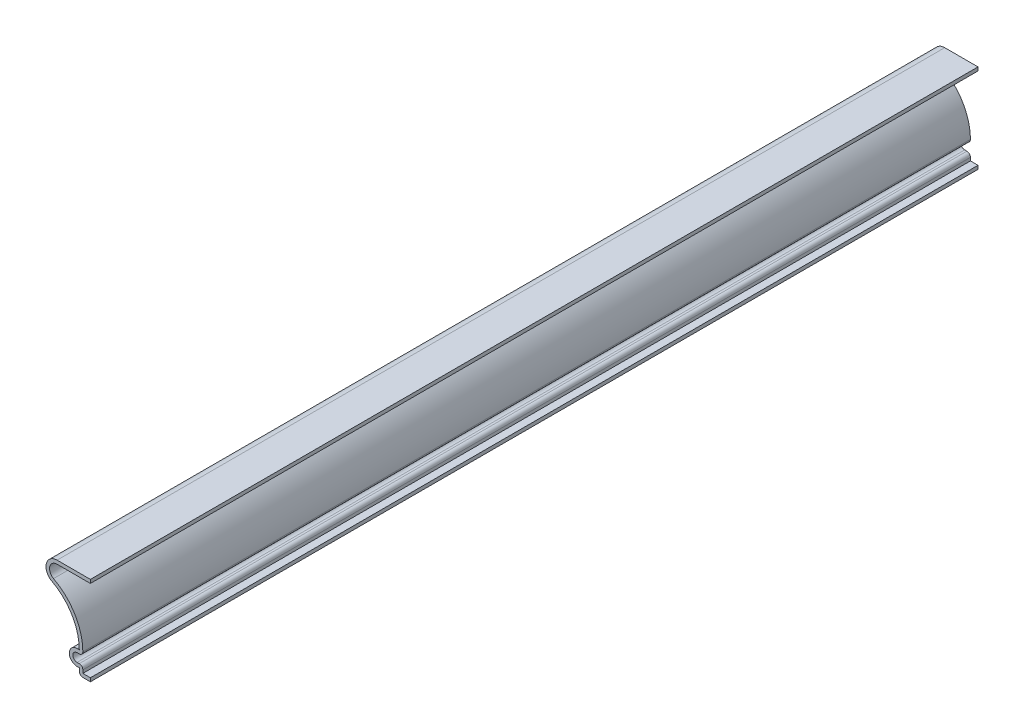
ISO-10303-21;
HEADER;
FILE_DESCRIPTION(('STEP AP214'),'2;1');
FILE_NAME('part.step','',(''),(''),'','','');
FILE_SCHEMA(('AUTOMOTIVE_DESIGN { 1 0 10303 214 1 1 1 1 }'));
ENDSEC;
DATA;
#1=APPLICATION_CONTEXT('core data for automotive mechanical design processes');
#2=APPLICATION_PROTOCOL_DEFINITION('international standard','automotive_design',2000,#1);
#3=PRODUCT_CONTEXT('',#1,'mechanical');
#4=PRODUCT('Part','Part','',(#3));
#5=PRODUCT_RELATED_PRODUCT_CATEGORY('part','',(#4));
#6=PRODUCT_DEFINITION_FORMATION('','',#4);
#7=PRODUCT_DEFINITION_CONTEXT('part definition',#1,'design');
#8=PRODUCT_DEFINITION('design','',#6,#7);
#9=PRODUCT_DEFINITION_SHAPE('','',#8);
#10=(LENGTH_UNIT() NAMED_UNIT(*) SI_UNIT(.MILLI.,.METRE.));
#11=(NAMED_UNIT(*) PLANE_ANGLE_UNIT() SI_UNIT($,.RADIAN.));
#12=(NAMED_UNIT(*) SI_UNIT($,.STERADIAN.) SOLID_ANGLE_UNIT());
#13=UNCERTAINTY_MEASURE_WITH_UNIT(LENGTH_MEASURE(1.E-05),#10,'distance_accuracy_value','');
#14=(GEOMETRIC_REPRESENTATION_CONTEXT(3) GLOBAL_UNCERTAINTY_ASSIGNED_CONTEXT((#13)) GLOBAL_UNIT_ASSIGNED_CONTEXT((#10,
#11,#12)) REPRESENTATION_CONTEXT('',''));
#15=CARTESIAN_POINT('',(0.,0.,0.));
#16=DIRECTION('',(0.,0.,1.));
#17=DIRECTION('',(1.,0.,0.));
#18=AXIS2_PLACEMENT_3D('',#15,#16,#17);
#19=CARTESIAN_POINT('',(0.,0.,-317.5));
#20=DIRECTION('',(0.,-1.,0.));
#21=DIRECTION('',(0.,0.,-1.));
#22=AXIS2_PLACEMENT_3D('',#19,#20,#21);
#23=PLANE('',#22);
#24=DIRECTION('',(1.,0.,0.));
#25=VECTOR('',#24,1.);
#26=CARTESIAN_POINT('',(0.,0.,0.));
#27=LINE('',#26,#25);
#28=CARTESIAN_POINT('',(-2.69875,0.,0.));
#29=VERTEX_POINT('',#28);
#30=CARTESIAN_POINT('',(0.,0.,0.));
#31=VERTEX_POINT('',#30);
#32=EDGE_CURVE('E372',#29,#31,#27,.T.);
#33=ORIENTED_EDGE('',*,*,#32,.F.);
#34=DIRECTION('',(0.,0.,1.));
#35=VECTOR('',#34,1.);
#36=CARTESIAN_POINT('',(-2.69875,0.,-317.5));
#37=LINE('',#36,#35);
#38=CARTESIAN_POINT('',(-2.69875,0.,-317.5));
#39=VERTEX_POINT('',#38);
#40=EDGE_CURVE('E193',#29,#39,#37,.F.);
#41=ORIENTED_EDGE('',*,*,#40,.T.);
#42=DIRECTION('',(1.,0.,0.));
#43=VECTOR('',#42,1.);
#44=CARTESIAN_POINT('',(0.,0.,-317.5));
#45=LINE('',#44,#43);
#46=CARTESIAN_POINT('',(0.,0.,-317.5));
#47=VERTEX_POINT('',#46);
#48=EDGE_CURVE('E186',#39,#47,#45,.T.);
#49=ORIENTED_EDGE('',*,*,#48,.T.);
#50=DIRECTION('',(0.,0.,1.));
#51=VECTOR('',#50,1.);
#52=CARTESIAN_POINT('',(0.,0.,-317.5));
#53=LINE('',#52,#51);
#54=EDGE_CURVE('E190',#47,#31,#53,.T.);
#55=ORIENTED_EDGE('',*,*,#54,.T.);
#56=EDGE_LOOP('',(#33,#41,#49,#55));
#57=FACE_BOUND('',#56,.T.);
#58=ADVANCED_FACE('F41',(#57),#23,.T.);
#59=CARTESIAN_POINT('',(-3.96875,0.,-317.5));
#60=DIRECTION('',(-1.,0.,0.));
#61=DIRECTION('',(0.,0.,1.));
#62=AXIS2_PLACEMENT_3D('',#59,#60,#61);
#63=PLANE('',#62);
#64=DIRECTION('',(0.,-1.,0.));
#65=VECTOR('',#64,1.);
#66=CARTESIAN_POINT('',(-3.96875,0.,-317.5));
#67=LINE('',#66,#65);
#68=CARTESIAN_POINT('',(-3.96875,2.38125,-317.5));
#69=VERTEX_POINT('',#68);
#70=CARTESIAN_POINT('',(-3.96875,1.27,-317.5));
#71=VERTEX_POINT('',#70);
#72=EDGE_CURVE('E213',#69,#71,#67,.T.);
#73=ORIENTED_EDGE('',*,*,#72,.T.);
#74=DIRECTION('',(0.,0.,1.));
#75=VECTOR('',#74,1.);
#76=CARTESIAN_POINT('',(-3.96875,1.27,-317.5));
#77=LINE('',#76,#75);
#78=CARTESIAN_POINT('',(-3.96875,1.27,0.));
#79=VERTEX_POINT('',#78);
#80=EDGE_CURVE('E224',#71,#79,#77,.T.);
#81=ORIENTED_EDGE('',*,*,#80,.T.);
#82=DIRECTION('',(0.,-1.,0.));
#83=VECTOR('',#82,1.);
#84=CARTESIAN_POINT('',(-3.96875,0.,0.));
#85=LINE('',#84,#83);
#86=CARTESIAN_POINT('',(-3.96875,2.38125,0.));
#87=VERTEX_POINT('',#86);
#88=EDGE_CURVE('E197',#87,#79,#85,.T.);
#89=ORIENTED_EDGE('',*,*,#88,.F.);
#90=DIRECTION('',(0.,0.,1.));
#91=VECTOR('',#90,1.);
#92=CARTESIAN_POINT('',(-3.96875,2.38125,-317.5));
#93=LINE('',#92,#91);
#94=EDGE_CURVE('E229',#69,#87,#93,.T.);
#95=ORIENTED_EDGE('',*,*,#94,.F.);
#96=EDGE_LOOP('',(#73,#81,#89,#95));
#97=FACE_BOUND('',#96,.T.);
#98=ADVANCED_FACE('F438',(#97),#63,.T.);
#99=CARTESIAN_POINT('',(-3.96875,2.38125,-317.5));
#100=DIRECTION('',(0.,-1.,0.));
#101=DIRECTION('',(1.,0.,0.));
#102=AXIS2_PLACEMENT_3D('',#99,#100,#101);
#103=PLANE('',#102);
#104=DIRECTION('',(1.,0.,0.));
#105=VECTOR('',#104,1.);
#106=CARTESIAN_POINT('',(-3.96875,2.38125,0.));
#107=LINE('',#106,#105);
#108=CARTESIAN_POINT('',(-4.7625,2.38125,0.));
#109=VERTEX_POINT('',#108);
#110=EDGE_CURVE('E313',#109,#87,#107,.T.);
#111=ORIENTED_EDGE('',*,*,#110,.F.);
#112=DIRECTION('',(0.,0.,1.));
#113=VECTOR('',#112,1.);
#114=CARTESIAN_POINT('',(-4.7625,2.38125,-317.5));
#115=LINE('',#114,#113);
#116=CARTESIAN_POINT('',(-4.7625,2.38125,-317.5));
#117=VERTEX_POINT('',#116);
#118=EDGE_CURVE('E321',#117,#109,#115,.T.);
#119=ORIENTED_EDGE('',*,*,#118,.F.);
#120=DIRECTION('',(1.,0.,0.));
#121=VECTOR('',#120,1.);
#122=CARTESIAN_POINT('',(-3.96875,2.38125,-317.5));
#123=LINE('',#122,#121);
#124=EDGE_CURVE('E220',#117,#69,#123,.T.);
#125=ORIENTED_EDGE('',*,*,#124,.T.);
#126=ORIENTED_EDGE('',*,*,#94,.T.);
#127=EDGE_LOOP('',(#111,#119,#125,#126));
#128=FACE_BOUND('',#127,.T.);
#129=ADVANCED_FACE('F442',(#128),#103,.T.);
#130=CARTESIAN_POINT('',(-4.7625,5.159375,-317.5));
#131=DIRECTION('',(0.,0.,1.));
#132=DIRECTION('',(1.,0.,0.));
#133=AXIS2_PLACEMENT_3D('',#130,#131,#132);
#134=CYLINDRICAL_SURFACE('',#133,2.778125);
#135=CARTESIAN_POINT('',(-4.7625,5.159375,0.));
#136=DIRECTION('',(0.,0.,1.));
#137=DIRECTION('',(-1.,0.,0.));
#138=AXIS2_PLACEMENT_3D('',#135,#136,#137);
#139=CIRCLE('',#138,2.778125);
#140=CARTESIAN_POINT('',(-4.7625,7.9375,0.));
#141=VERTEX_POINT('',#140);
#142=EDGE_CURVE('E309',#141,#109,#139,.T.);
#143=ORIENTED_EDGE('',*,*,#142,.F.);
#144=DIRECTION('',(0.,0.,1.));
#145=VECTOR('',#144,1.);
#146=CARTESIAN_POINT('',(-4.7625,7.9375,-317.5));
#147=LINE('',#146,#145);
#148=CARTESIAN_POINT('',(-4.7625,7.9375,-317.5));
#149=VERTEX_POINT('',#148);
#150=EDGE_CURVE('E324',#149,#141,#147,.T.);
#151=ORIENTED_EDGE('',*,*,#150,.F.);
#152=CARTESIAN_POINT('',(-4.7625,5.159375,-317.5));
#153=DIRECTION('',(0.,0.,1.));
#154=DIRECTION('',(-1.,0.,0.));
#155=AXIS2_PLACEMENT_3D('',#152,#153,#154);
#156=CIRCLE('',#155,2.778125);
#157=EDGE_CURVE('E425',#149,#117,#156,.T.);
#158=ORIENTED_EDGE('',*,*,#157,.T.);
#159=ORIENTED_EDGE('',*,*,#118,.T.);
#160=EDGE_LOOP('',(#143,#151,#158,#159));
#161=FACE_BOUND('',#160,.T.);
#162=ADVANCED_FACE('F447',(#161),#134,.T.);
#163=CARTESIAN_POINT('',(-4.7625,7.9375,-317.5));
#164=DIRECTION('',(0.,1.,0.));
#165=DIRECTION('',(0.,0.,1.));
#166=AXIS2_PLACEMENT_3D('',#163,#164,#165);
#167=PLANE('',#166);
#168=DIRECTION('',(-1.,0.,0.));
#169=VECTOR('',#168,1.);
#170=CARTESIAN_POINT('',(-4.7625,7.9375,0.));
#171=LINE('',#170,#169);
#172=CARTESIAN_POINT('',(-3.96875,7.9375,0.));
#173=VERTEX_POINT('',#172);
#174=EDGE_CURVE('E305',#173,#141,#171,.T.);
#175=ORIENTED_EDGE('',*,*,#174,.F.);
#176=DIRECTION('',(0.,0.,1.));
#177=VECTOR('',#176,1.);
#178=CARTESIAN_POINT('',(-3.96875,7.9375,-317.5));
#179=LINE('',#178,#177);
#180=CARTESIAN_POINT('',(-3.96875,7.9375,-317.5));
#181=VERTEX_POINT('',#180);
#182=EDGE_CURVE('E327',#181,#173,#179,.T.);
#183=ORIENTED_EDGE('',*,*,#182,.F.);
#184=DIRECTION('',(-1.,0.,0.));
#185=VECTOR('',#184,1.);
#186=CARTESIAN_POINT('',(-4.7625,7.9375,-317.5));
#187=LINE('',#186,#185);
#188=EDGE_CURVE('E421',#181,#149,#187,.T.);
#189=ORIENTED_EDGE('',*,*,#188,.T.);
#190=ORIENTED_EDGE('',*,*,#150,.T.);
#191=EDGE_LOOP('',(#175,#183,#189,#190));
#192=FACE_BOUND('',#191,.T.);
#193=ADVANCED_FACE('F450',(#192),#167,.T.);
#194=CARTESIAN_POINT('',(-22.4895833333332,7.9375,-317.5));
#195=DIRECTION('',(0.,0.,1.));
#196=DIRECTION('',(1.,0.,0.));
#197=AXIS2_PLACEMENT_3D('',#194,#195,#196);
#198=CYLINDRICAL_SURFACE('',#197,18.5208333333332);
#199=CARTESIAN_POINT('',(-22.4895833333332,7.9375,0.));
#200=DIRECTION('',(0.,0.,-1.));
#201=DIRECTION('',(-1.,0.,0.));
#202=AXIS2_PLACEMENT_3D('',#199,#200,#201);
#203=CIRCLE('',#202,18.5208333333332);
#204=CARTESIAN_POINT('',(-13.7738970588235,24.2794117647058,0.));
#205=VERTEX_POINT('',#204);
#206=EDGE_CURVE('E301',#205,#173,#203,.T.);
#207=ORIENTED_EDGE('',*,*,#206,.F.);
#208=DIRECTION('',(0.,0.,1.));
#209=VECTOR('',#208,1.);
#210=CARTESIAN_POINT('',(-13.7738970588235,24.2794117647058,-317.5));
#211=LINE('',#210,#209);
#212=CARTESIAN_POINT('',(-13.7738970588235,24.2794117647058,-317.5));
#213=VERTEX_POINT('',#212);
#214=EDGE_CURVE('E330',#213,#205,#211,.T.);
#215=ORIENTED_EDGE('',*,*,#214,.F.);
#216=CARTESIAN_POINT('',(-22.4895833333332,7.9375,-317.5));
#217=DIRECTION('',(0.,0.,-1.));
#218=DIRECTION('',(-1.,0.,0.));
#219=AXIS2_PLACEMENT_3D('',#216,#217,#218);
#220=CIRCLE('',#219,18.5208333333332);
#221=EDGE_CURVE('E417',#213,#181,#220,.T.);
#222=ORIENTED_EDGE('',*,*,#221,.T.);
#223=ORIENTED_EDGE('',*,*,#182,.T.);
#224=EDGE_LOOP('',(#207,#215,#222,#223));
#225=FACE_BOUND('',#224,.T.);
#226=ADVANCED_FACE('F455',(#225),#198,.F.);
#227=CARTESIAN_POINT('',(-11.90625,27.78125,-317.5));
#228=DIRECTION('',(0.,0.,1.));
#229=DIRECTION('',(1.,0.,0.));
#230=AXIS2_PLACEMENT_3D('',#227,#228,#229);
#231=CYLINDRICAL_SURFACE('',#230,3.96875000000003);
#232=CARTESIAN_POINT('',(-11.90625,27.78125,0.));
#233=DIRECTION('',(0.,0.,1.));
#234=DIRECTION('',(1.,0.,0.));
#235=AXIS2_PLACEMENT_3D('',#232,#233,#234);
#236=CIRCLE('',#235,3.96875000000003);
#237=CARTESIAN_POINT('',(-11.90625,31.75,0.));
#238=VERTEX_POINT('',#237);
#239=EDGE_CURVE('E297',#238,#205,#236,.T.);
#240=ORIENTED_EDGE('',*,*,#239,.F.);
#241=DIRECTION('',(0.,0.,1.));
#242=VECTOR('',#241,1.);
#243=CARTESIAN_POINT('',(-11.90625,31.75,-317.5));
#244=LINE('',#243,#242);
#245=CARTESIAN_POINT('',(-11.90625,31.75,-317.5));
#246=VERTEX_POINT('',#245);
#247=EDGE_CURVE('E333',#246,#238,#244,.T.);
#248=ORIENTED_EDGE('',*,*,#247,.F.);
#249=CARTESIAN_POINT('',(-11.90625,27.78125,-317.5));
#250=DIRECTION('',(0.,0.,1.));
#251=DIRECTION('',(1.,0.,0.));
#252=AXIS2_PLACEMENT_3D('',#249,#250,#251);
#253=CIRCLE('',#252,3.96875000000003);
#254=EDGE_CURVE('E413',#246,#213,#253,.T.);
#255=ORIENTED_EDGE('',*,*,#254,.T.);
#256=ORIENTED_EDGE('',*,*,#214,.T.);
#257=EDGE_LOOP('',(#240,#248,#255,#256));
#258=FACE_BOUND('',#257,.T.);
#259=ADVANCED_FACE('F458',(#258),#231,.T.);
#260=CARTESIAN_POINT('',(0.,31.75,-317.5));
#261=DIRECTION('',(0.,1.,0.));
#262=DIRECTION('',(0.,0.,1.));
#263=AXIS2_PLACEMENT_3D('',#260,#261,#262);
#264=PLANE('',#263);
#265=DIRECTION('',(-1.,0.,0.));
#266=VECTOR('',#265,1.);
#267=CARTESIAN_POINT('',(0.,31.75,0.));
#268=LINE('',#267,#266);
#269=CARTESIAN_POINT('',(0.,31.75,0.));
#270=VERTEX_POINT('',#269);
#271=EDGE_CURVE('E293',#270,#238,#268,.T.);
#272=ORIENTED_EDGE('',*,*,#271,.F.);
#273=DIRECTION('',(0.,0.,1.));
#274=VECTOR('',#273,1.);
#275=CARTESIAN_POINT('',(0.,31.75,-317.5));
#276=LINE('',#275,#274);
#277=CARTESIAN_POINT('',(0.,31.75,-317.5));
#278=VERTEX_POINT('',#277);
#279=EDGE_CURVE('E336',#278,#270,#276,.T.);
#280=ORIENTED_EDGE('',*,*,#279,.F.);
#281=DIRECTION('',(-1.,0.,0.));
#282=VECTOR('',#281,1.);
#283=CARTESIAN_POINT('',(0.,31.75,-317.5));
#284=LINE('',#283,#282);
#285=EDGE_CURVE('E409',#278,#246,#284,.T.);
#286=ORIENTED_EDGE('',*,*,#285,.T.);
#287=ORIENTED_EDGE('',*,*,#247,.T.);
#288=EDGE_LOOP('',(#272,#280,#286,#287));
#289=FACE_BOUND('',#288,.T.);
#290=ADVANCED_FACE('F462',(#289),#264,.T.);
#291=CARTESIAN_POINT('',(0.,31.75,-317.5));
#292=DIRECTION('',(-1.,0.,0.));
#293=DIRECTION('',(0.,0.,1.));
#294=AXIS2_PLACEMENT_3D('',#291,#292,#293);
#295=PLANE('',#294);
#296=DIRECTION('',(0.,-1.,0.));
#297=VECTOR('',#296,1.);
#298=CARTESIAN_POINT('',(0.,31.75,0.));
#299=LINE('',#298,#297);
#300=CARTESIAN_POINT('',(0.,30.48,0.));
#301=VERTEX_POINT('',#300);
#302=EDGE_CURVE('E290',#270,#301,#299,.T.);
#303=ORIENTED_EDGE('',*,*,#302,.T.);
#304=DIRECTION('',(0.,0.,1.));
#305=VECTOR('',#304,1.);
#306=CARTESIAN_POINT('',(0.,30.48,-317.5));
#307=LINE('',#306,#305);
#308=CARTESIAN_POINT('',(0.,30.48,-317.5));
#309=VERTEX_POINT('',#308);
#310=EDGE_CURVE('E339',#309,#301,#307,.T.);
#311=ORIENTED_EDGE('',*,*,#310,.F.);
#312=DIRECTION('',(0.,-1.,0.));
#313=VECTOR('',#312,1.);
#314=CARTESIAN_POINT('',(0.,31.75,-317.5));
#315=LINE('',#314,#313);
#316=EDGE_CURVE('E406',#278,#309,#315,.T.);
#317=ORIENTED_EDGE('',*,*,#316,.F.);
#318=ORIENTED_EDGE('',*,*,#279,.T.);
#319=EDGE_LOOP('',(#303,#311,#317,#318));
#320=FACE_BOUND('',#319,.T.);
#321=ADVANCED_FACE('F467',(#320),#295,.F.);
#322=CARTESIAN_POINT('',(0.,30.48,-317.5));
#323=DIRECTION('',(0.,1.,0.));
#324=DIRECTION('',(0.,0.,1.));
#325=AXIS2_PLACEMENT_3D('',#322,#323,#324);
#326=PLANE('',#325);
#327=DIRECTION('',(1.,0.,0.));
#328=VECTOR('',#327,1.);
#329=CARTESIAN_POINT('',(0.,30.48,0.));
#330=LINE('',#329,#328);
#331=CARTESIAN_POINT('',(-11.90625,30.48,0.));
#332=VERTEX_POINT('',#331);
#333=EDGE_CURVE('E287',#301,#332,#330,.F.);
#334=ORIENTED_EDGE('',*,*,#333,.T.);
#335=DIRECTION('',(0.,0.,1.));
#336=VECTOR('',#335,1.);
#337=CARTESIAN_POINT('',(-11.90625,30.48,-317.5));
#338=LINE('',#337,#336);
#339=CARTESIAN_POINT('',(-11.90625,30.48,-317.5));
#340=VERTEX_POINT('',#339);
#341=EDGE_CURVE('E343',#340,#332,#338,.T.);
#342=ORIENTED_EDGE('',*,*,#341,.F.);
#343=DIRECTION('',(1.,0.,0.));
#344=VECTOR('',#343,1.);
#345=CARTESIAN_POINT('',(0.,30.48,-317.5));
#346=LINE('',#345,#344);
#347=EDGE_CURVE('E403',#309,#340,#346,.F.);
#348=ORIENTED_EDGE('',*,*,#347,.F.);
#349=ORIENTED_EDGE('',*,*,#310,.T.);
#350=EDGE_LOOP('',(#334,#342,#348,#349));
#351=FACE_BOUND('',#350,.T.);
#352=ADVANCED_FACE('F473',(#351),#326,.F.);
#353=CARTESIAN_POINT('',(-11.90625,27.78125,-317.5));
#354=DIRECTION('',(0.,0.,1.));
#355=DIRECTION('',(1.,0.,0.));
#356=AXIS2_PLACEMENT_3D('',#353,#354,#355);
#357=CYLINDRICAL_SURFACE('',#356,2.69875000000003);
#358=CARTESIAN_POINT('',(-11.90625,27.78125,0.));
#359=DIRECTION('',(0.,0.,1.));
#360=DIRECTION('',(1.,0.,0.));
#361=AXIS2_PLACEMENT_3D('',#358,#359,#360);
#362=CIRCLE('',#361,2.69875000000003);
#363=CARTESIAN_POINT('',(-13.17625,25.3999999999999,0.));
#364=VERTEX_POINT('',#363);
#365=EDGE_CURVE('E279',#332,#364,#362,.T.);
#366=ORIENTED_EDGE('',*,*,#365,.T.);
#367=DIRECTION('',(0.,0.,1.));
#368=VECTOR('',#367,1.);
#369=CARTESIAN_POINT('',(-13.17625,25.3999999999999,-317.5));
#370=LINE('',#369,#368);
#371=CARTESIAN_POINT('',(-13.17625,25.3999999999999,-317.5));
#372=VERTEX_POINT('',#371);
#373=EDGE_CURVE('E347',#372,#364,#370,.T.);
#374=ORIENTED_EDGE('',*,*,#373,.F.);
#375=CARTESIAN_POINT('',(-11.90625,27.78125,-317.5));
#376=DIRECTION('',(0.,0.,1.));
#377=DIRECTION('',(1.,0.,0.));
#378=AXIS2_PLACEMENT_3D('',#375,#376,#377);
#379=CIRCLE('',#378,2.69875000000003);
#380=EDGE_CURVE('E400',#340,#372,#379,.T.);
#381=ORIENTED_EDGE('',*,*,#380,.F.);
#382=ORIENTED_EDGE('',*,*,#341,.T.);
#383=EDGE_LOOP('',(#366,#374,#381,#382));
#384=FACE_BOUND('',#383,.T.);
#385=ADVANCED_FACE('F477',(#384),#357,.F.);
#386=CARTESIAN_POINT('',(-22.4895833333332,7.9375,-317.5));
#387=DIRECTION('',(0.,0.,1.));
#388=DIRECTION('',(1.,0.,0.));
#389=AXIS2_PLACEMENT_3D('',#386,#387,#388);
#390=CYLINDRICAL_SURFACE('',#389,19.7908333333332);
#391=CARTESIAN_POINT('',(-22.4895833333332,7.9375,0.));
#392=DIRECTION('',(0.,0.,1.));
#393=DIRECTION('',(1.,0.,0.));
#394=AXIS2_PLACEMENT_3D('',#391,#392,#393);
#395=CIRCLE('',#394,19.7908333333332);
#396=CARTESIAN_POINT('',(-2.69875,7.9375,0.));
#397=VERTEX_POINT('',#396);
#398=EDGE_CURVE('E275',#364,#397,#395,.F.);
#399=ORIENTED_EDGE('',*,*,#398,.T.);
#400=DIRECTION('',(0.,0.,1.));
#401=VECTOR('',#400,1.);
#402=CARTESIAN_POINT('',(-2.69875,7.9375,-317.5));
#403=LINE('',#402,#401);
#404=CARTESIAN_POINT('',(-2.69875,7.9375,-317.5));
#405=VERTEX_POINT('',#404);
#406=EDGE_CURVE('E11',#397,#405,#403,.F.);
#407=ORIENTED_EDGE('',*,*,#406,.T.);
#408=CARTESIAN_POINT('',(-22.4895833333332,7.9375,-317.5));
#409=DIRECTION('',(0.,0.,1.));
#410=DIRECTION('',(1.,0.,0.));
#411=AXIS2_PLACEMENT_3D('',#408,#409,#410);
#412=CIRCLE('',#411,19.7908333333332);
#413=EDGE_CURVE('E396',#372,#405,#412,.F.);
#414=ORIENTED_EDGE('',*,*,#413,.F.);
#415=ORIENTED_EDGE('',*,*,#373,.T.);
#416=EDGE_LOOP('',(#399,#407,#414,#415));
#417=FACE_BOUND('',#416,.T.);
#418=ADVANCED_FACE('F480',(#417),#390,.T.);
#419=CARTESIAN_POINT('',(-4.7625,6.6675,-317.5));
#420=DIRECTION('',(0.,1.,0.));
#421=DIRECTION('',(0.,0.,1.));
#422=AXIS2_PLACEMENT_3D('',#419,#420,#421);
#423=PLANE('',#422);
#424=DIRECTION('',(1.,0.,0.));
#425=VECTOR('',#424,1.);
#426=CARTESIAN_POINT('',(-4.7625,6.6675,-317.5));
#427=LINE('',#426,#425);
#428=CARTESIAN_POINT('',(-3.96875,6.6675,-317.5));
#429=VERTEX_POINT('',#428);
#430=CARTESIAN_POINT('',(-4.7625,6.6675,-317.5));
#431=VERTEX_POINT('',#430);
#432=EDGE_CURVE('E263',#429,#431,#427,.F.);
#433=ORIENTED_EDGE('',*,*,#432,.F.);
#434=DIRECTION('',(0.,0.,1.));
#435=VECTOR('',#434,1.);
#436=CARTESIAN_POINT('',(-3.96875,6.6675,-317.5));
#437=LINE('',#436,#435);
#438=CARTESIAN_POINT('',(-3.96875,6.6675,0.));
#439=VERTEX_POINT('',#438);
#440=EDGE_CURVE('E50',#429,#439,#437,.T.);
#441=ORIENTED_EDGE('',*,*,#440,.T.);
#442=DIRECTION('',(1.,0.,0.));
#443=VECTOR('',#442,1.);
#444=CARTESIAN_POINT('',(-4.7625,6.6675,0.));
#445=LINE('',#444,#443);
#446=CARTESIAN_POINT('',(-4.7625,6.6675,0.));
#447=VERTEX_POINT('',#446);
#448=EDGE_CURVE('E261',#439,#447,#445,.F.);
#449=ORIENTED_EDGE('',*,*,#448,.T.);
#450=DIRECTION('',(0.,0.,1.));
#451=VECTOR('',#450,1.);
#452=CARTESIAN_POINT('',(-4.7625,6.6675,-317.5));
#453=LINE('',#452,#451);
#454=EDGE_CURVE('E351',#431,#447,#453,.T.);
#455=ORIENTED_EDGE('',*,*,#454,.F.);
#456=EDGE_LOOP('',(#433,#441,#449,#455));
#457=FACE_BOUND('',#456,.T.);
#458=ADVANCED_FACE('F259',(#457),#423,.F.);
#459=CARTESIAN_POINT('',(-4.7625,5.159375,-317.5));
#460=DIRECTION('',(0.,0.,1.));
#461=DIRECTION('',(1.,0.,0.));
#462=AXIS2_PLACEMENT_3D('',#459,#460,#461);
#463=CYLINDRICAL_SURFACE('',#462,1.508125);
#464=CARTESIAN_POINT('',(-4.7625,5.159375,0.));
#465=DIRECTION('',(0.,0.,1.));
#466=DIRECTION('',(1.,0.,0.));
#467=AXIS2_PLACEMENT_3D('',#464,#465,#466);
#468=CIRCLE('',#467,1.508125);
#469=CARTESIAN_POINT('',(-4.7625,3.65125,0.));
#470=VERTEX_POINT('',#469);
#471=EDGE_CURVE('E273',#447,#470,#468,.T.);
#472=ORIENTED_EDGE('',*,*,#471,.T.);
#473=DIRECTION('',(0.,0.,1.));
#474=VECTOR('',#473,1.);
#475=CARTESIAN_POINT('',(-4.7625,3.65125,-317.5));
#476=LINE('',#475,#474);
#477=CARTESIAN_POINT('',(-4.7625,3.65125,-317.5));
#478=VERTEX_POINT('',#477);
#479=EDGE_CURVE('E354',#478,#470,#476,.T.);
#480=ORIENTED_EDGE('',*,*,#479,.F.);
#481=CARTESIAN_POINT('',(-4.7625,5.159375,-317.5));
#482=DIRECTION('',(0.,0.,1.));
#483=DIRECTION('',(1.,0.,0.));
#484=AXIS2_PLACEMENT_3D('',#481,#482,#483);
#485=CIRCLE('',#484,1.508125);
#486=EDGE_CURVE('E388',#431,#478,#485,.T.);
#487=ORIENTED_EDGE('',*,*,#486,.F.);
#488=ORIENTED_EDGE('',*,*,#454,.T.);
#489=EDGE_LOOP('',(#472,#480,#487,#488));
#490=FACE_BOUND('',#489,.T.);
#491=ADVANCED_FACE('F527',(#490),#463,.F.);
#492=CARTESIAN_POINT('',(-3.96875,3.65125,-317.5));
#493=DIRECTION('',(0.,-1.,0.));
#494=DIRECTION('',(1.,0.,0.));
#495=AXIS2_PLACEMENT_3D('',#492,#493,#494);
#496=PLANE('',#495);
#497=DIRECTION('',(1.,0.,0.));
#498=VECTOR('',#497,1.);
#499=CARTESIAN_POINT('',(-3.96875,3.65125,0.));
#500=LINE('',#499,#498);
#501=CARTESIAN_POINT('',(-3.96875,3.65125,0.));
#502=VERTEX_POINT('',#501);
#503=EDGE_CURVE('E281',#470,#502,#500,.T.);
#504=ORIENTED_EDGE('',*,*,#503,.T.);
#505=DIRECTION('',(0.,0.,1.));
#506=VECTOR('',#505,1.);
#507=CARTESIAN_POINT('',(-3.96875,3.65125,-317.5));
#508=LINE('',#507,#506);
#509=CARTESIAN_POINT('',(-3.96875,3.65125,-317.5));
#510=VERTEX_POINT('',#509);
#511=EDGE_CURVE('E65',#502,#510,#508,.F.);
#512=ORIENTED_EDGE('',*,*,#511,.T.);
#513=DIRECTION('',(1.,0.,0.));
#514=VECTOR('',#513,1.);
#515=CARTESIAN_POINT('',(-3.96875,3.65125,-317.5));
#516=LINE('',#515,#514);
#517=EDGE_CURVE('E384',#478,#510,#516,.T.);
#518=ORIENTED_EDGE('',*,*,#517,.F.);
#519=ORIENTED_EDGE('',*,*,#479,.T.);
#520=EDGE_LOOP('',(#504,#512,#518,#519));
#521=FACE_BOUND('',#520,.T.);
#522=ADVANCED_FACE('F376',(#521),#496,.F.);
#523=CARTESIAN_POINT('',(-2.69875,0.,-317.5));
#524=DIRECTION('',(-1.,0.,0.));
#525=DIRECTION('',(0.,0.,1.));
#526=AXIS2_PLACEMENT_3D('',#523,#524,#525);
#527=PLANE('',#526);
#528=DIRECTION('',(0.,1.,0.));
#529=VECTOR('',#528,1.);
#530=CARTESIAN_POINT('',(-2.69875,0.,-317.5));
#531=LINE('',#530,#529);
#532=CARTESIAN_POINT('',(-2.69875,2.38125,-317.5));
#533=VERTEX_POINT('',#532);
#534=CARTESIAN_POINT('',(-2.69875,1.27,-317.5));
#535=VERTEX_POINT('',#534);
#536=EDGE_CURVE('E382',#533,#535,#531,.F.);
#537=ORIENTED_EDGE('',*,*,#536,.F.);
#538=DIRECTION('',(0.,0.,1.));
#539=VECTOR('',#538,1.);
#540=CARTESIAN_POINT('',(-2.69875,2.38125,-317.5));
#541=LINE('',#540,#539);
#542=CARTESIAN_POINT('',(-2.69875,2.38125,0.));
#543=VERTEX_POINT('',#542);
#544=EDGE_CURVE('E248',#533,#543,#541,.T.);
#545=ORIENTED_EDGE('',*,*,#544,.T.);
#546=DIRECTION('',(0.,1.,0.));
#547=VECTOR('',#546,1.);
#548=CARTESIAN_POINT('',(-2.69875,0.,0.));
#549=LINE('',#548,#547);
#550=CARTESIAN_POINT('',(-2.69875,1.27,0.));
#551=VERTEX_POINT('',#550);
#552=EDGE_CURVE('E366',#543,#551,#549,.F.);
#553=ORIENTED_EDGE('',*,*,#552,.T.);
#554=DIRECTION('',(0.,0.,1.));
#555=VECTOR('',#554,1.);
#556=CARTESIAN_POINT('',(-2.69875,1.27,-317.5));
#557=LINE('',#556,#555);
#558=EDGE_CURVE('E217',#535,#551,#557,.T.);
#559=ORIENTED_EDGE('',*,*,#558,.F.);
#560=EDGE_LOOP('',(#537,#545,#553,#559));
#561=FACE_BOUND('',#560,.T.);
#562=ADVANCED_FACE('F381',(#561),#527,.F.);
#563=CARTESIAN_POINT('',(0.,1.27,-317.5));
#564=DIRECTION('',(0.,-1.,0.));
#565=DIRECTION('',(0.,0.,-1.));
#566=AXIS2_PLACEMENT_3D('',#563,#564,#565);
#567=PLANE('',#566);
#568=DIRECTION('',(1.,0.,0.));
#569=VECTOR('',#568,1.);
#570=CARTESIAN_POINT('',(0.,1.27,0.));
#571=LINE('',#570,#569);
#572=CARTESIAN_POINT('',(0.,1.27,0.));
#573=VERTEX_POINT('',#572);
#574=EDGE_CURVE('E363',#551,#573,#571,.T.);
#575=ORIENTED_EDGE('',*,*,#574,.T.);
#576=DIRECTION('',(0.,0.,1.));
#577=VECTOR('',#576,1.);
#578=CARTESIAN_POINT('',(0.,1.27,-317.5));
#579=LINE('',#578,#577);
#580=CARTESIAN_POINT('',(0.,1.27,-317.5));
#581=VERTEX_POINT('',#580);
#582=EDGE_CURVE('E212',#581,#573,#579,.T.);
#583=ORIENTED_EDGE('',*,*,#582,.F.);
#584=DIRECTION('',(1.,0.,0.));
#585=VECTOR('',#584,1.);
#586=CARTESIAN_POINT('',(0.,1.27,-317.5));
#587=LINE('',#586,#585);
#588=EDGE_CURVE('E202',#535,#581,#587,.T.);
#589=ORIENTED_EDGE('',*,*,#588,.F.);
#590=ORIENTED_EDGE('',*,*,#558,.T.);
#591=EDGE_LOOP('',(#575,#583,#589,#590));
#592=FACE_BOUND('',#591,.T.);
#593=ADVANCED_FACE('F362',(#592),#567,.F.);
#594=CARTESIAN_POINT('',(0.,1.27,-317.5));
#595=DIRECTION('',(-1.,0.,0.));
#596=DIRECTION('',(0.,0.,1.));
#597=AXIS2_PLACEMENT_3D('',#594,#595,#596);
#598=PLANE('',#597);
#599=DIRECTION('',(0.,-1.,0.));
#600=VECTOR('',#599,1.);
#601=CARTESIAN_POINT('',(0.,1.27,0.));
#602=LINE('',#601,#600);
#603=EDGE_CURVE('E210',#573,#31,#602,.T.);
#604=ORIENTED_EDGE('',*,*,#603,.T.);
#605=ORIENTED_EDGE('',*,*,#54,.F.);
#606=DIRECTION('',(0.,-1.,0.));
#607=VECTOR('',#606,1.);
#608=CARTESIAN_POINT('',(0.,1.27,-317.5));
#609=LINE('',#608,#607);
#610=EDGE_CURVE('E196',#581,#47,#609,.T.);
#611=ORIENTED_EDGE('',*,*,#610,.F.);
#612=ORIENTED_EDGE('',*,*,#582,.T.);
#613=EDGE_LOOP('',(#604,#605,#611,#612));
#614=FACE_BOUND('',#613,.T.);
#615=ADVANCED_FACE('F208',(#614),#598,.F.);
#616=CARTESIAN_POINT('',(-4.7625,5.159375,-317.5));
#617=DIRECTION('',(0.,0.,1.));
#618=DIRECTION('',(1.,0.,0.));
#619=AXIS2_PLACEMENT_3D('',#616,#617,#618);
#620=PLANE('',#619);
#621=ORIENTED_EDGE('',*,*,#48,.F.);
#622=CARTESIAN_POINT('',(-2.69875,1.27,-317.5));
#623=DIRECTION('',(0.,0.,1.));
#624=DIRECTION('',(1.,0.,0.));
#625=AXIS2_PLACEMENT_3D('',#622,#623,#624);
#626=CIRCLE('',#625,1.27);
#627=EDGE_CURVE('E245',#39,#71,#626,.F.);
#628=ORIENTED_EDGE('',*,*,#627,.T.);
#629=ORIENTED_EDGE('',*,*,#72,.F.);
#630=ORIENTED_EDGE('',*,*,#124,.F.);
#631=ORIENTED_EDGE('',*,*,#157,.F.);
#632=ORIENTED_EDGE('',*,*,#188,.F.);
#633=ORIENTED_EDGE('',*,*,#221,.F.);
#634=ORIENTED_EDGE('',*,*,#254,.F.);
#635=ORIENTED_EDGE('',*,*,#285,.F.);
#636=ORIENTED_EDGE('',*,*,#316,.T.);
#637=ORIENTED_EDGE('',*,*,#347,.T.);
#638=ORIENTED_EDGE('',*,*,#380,.T.);
#639=ORIENTED_EDGE('',*,*,#413,.T.);
#640=CARTESIAN_POINT('',(-3.96875,7.9375,-317.5));
#641=DIRECTION('',(0.,0.,1.));
#642=DIRECTION('',(1.,0.,0.));
#643=AXIS2_PLACEMENT_3D('',#640,#641,#642);
#644=CIRCLE('',#643,1.27);
#645=EDGE_CURVE('E240',#405,#429,#644,.F.);
#646=ORIENTED_EDGE('',*,*,#645,.T.);
#647=ORIENTED_EDGE('',*,*,#432,.T.);
#648=ORIENTED_EDGE('',*,*,#486,.T.);
#649=ORIENTED_EDGE('',*,*,#517,.T.);
#650=CARTESIAN_POINT('',(-3.96875,2.38125,-317.5));
#651=DIRECTION('',(0.,0.,1.));
#652=DIRECTION('',(1.,0.,0.));
#653=AXIS2_PLACEMENT_3D('',#650,#651,#652);
#654=CIRCLE('',#653,1.27);
#655=EDGE_CURVE('E57',#510,#533,#654,.F.);
#656=ORIENTED_EDGE('',*,*,#655,.T.);
#657=ORIENTED_EDGE('',*,*,#536,.T.);
#658=ORIENTED_EDGE('',*,*,#588,.T.);
#659=ORIENTED_EDGE('',*,*,#610,.T.);
#660=EDGE_LOOP('',(#621,#628,#629,#630,#631,#632,#633,#634,#635,#636,#637,#638,#639,#646,#647,
#648,#649,#656,#657,#658,#659));
#661=FACE_BOUND('',#660,.T.);
#662=ADVANCED_FACE('F200',(#661),#620,.F.);
#663=CARTESIAN_POINT('',(-4.7625,5.159375,0.));
#664=DIRECTION('',(0.,0.,1.));
#665=DIRECTION('',(1.,0.,0.));
#666=AXIS2_PLACEMENT_3D('',#663,#664,#665);
#667=PLANE('',#666);
#668=ORIENTED_EDGE('',*,*,#88,.T.);
#669=CARTESIAN_POINT('',(-2.69875,1.27,0.));
#670=DIRECTION('',(0.,0.,1.));
#671=DIRECTION('',(1.,0.,0.));
#672=AXIS2_PLACEMENT_3D('',#669,#670,#671);
#673=CIRCLE('',#672,1.27);
#674=EDGE_CURVE('E235',#79,#29,#673,.T.);
#675=ORIENTED_EDGE('',*,*,#674,.T.);
#676=ORIENTED_EDGE('',*,*,#32,.T.);
#677=ORIENTED_EDGE('',*,*,#603,.F.);
#678=ORIENTED_EDGE('',*,*,#574,.F.);
#679=ORIENTED_EDGE('',*,*,#552,.F.);
#680=CARTESIAN_POINT('',(-3.96875,2.38125,0.));
#681=DIRECTION('',(0.,0.,1.));
#682=DIRECTION('',(1.,0.,0.));
#683=AXIS2_PLACEMENT_3D('',#680,#681,#682);
#684=CIRCLE('',#683,1.27);
#685=EDGE_CURVE('E232',#543,#502,#684,.T.);
#686=ORIENTED_EDGE('',*,*,#685,.T.);
#687=ORIENTED_EDGE('',*,*,#503,.F.);
#688=ORIENTED_EDGE('',*,*,#471,.F.);
#689=ORIENTED_EDGE('',*,*,#448,.F.);
#690=CARTESIAN_POINT('',(-3.96875,7.9375,0.));
#691=DIRECTION('',(0.,0.,1.));
#692=DIRECTION('',(1.,0.,0.));
#693=AXIS2_PLACEMENT_3D('',#690,#691,#692);
#694=CIRCLE('',#693,1.27);
#695=EDGE_CURVE('E228',#439,#397,#694,.T.);
#696=ORIENTED_EDGE('',*,*,#695,.T.);
#697=ORIENTED_EDGE('',*,*,#398,.F.);
#698=ORIENTED_EDGE('',*,*,#365,.F.);
#699=ORIENTED_EDGE('',*,*,#333,.F.);
#700=ORIENTED_EDGE('',*,*,#302,.F.);
#701=ORIENTED_EDGE('',*,*,#271,.T.);
#702=ORIENTED_EDGE('',*,*,#239,.T.);
#703=ORIENTED_EDGE('',*,*,#206,.T.);
#704=ORIENTED_EDGE('',*,*,#174,.T.);
#705=ORIENTED_EDGE('',*,*,#142,.T.);
#706=ORIENTED_EDGE('',*,*,#110,.T.);
#707=EDGE_LOOP('',(#668,#675,#676,#677,#678,#679,#686,#687,#688,#689,#696,#697,#698,#699,#700,
#701,#702,#703,#704,#705,#706));
#708=FACE_BOUND('',#707,.T.);
#709=ADVANCED_FACE('F269',(#708),#667,.T.);
#710=CARTESIAN_POINT('',(-2.69875,1.27,-317.5));
#711=DIRECTION('',(0.,0.,1.));
#712=DIRECTION('',(1.,0.,0.));
#713=AXIS2_PLACEMENT_3D('',#710,#711,#712);
#714=CYLINDRICAL_SURFACE('',#713,1.27);
#715=ORIENTED_EDGE('',*,*,#627,.F.);
#716=ORIENTED_EDGE('',*,*,#40,.F.);
#717=ORIENTED_EDGE('',*,*,#674,.F.);
#718=ORIENTED_EDGE('',*,*,#80,.F.);
#719=EDGE_LOOP('',(#715,#716,#717,#718));
#720=FACE_BOUND('',#719,.T.);
#721=ADVANCED_FACE('F433',(#720),#714,.T.);
#722=CARTESIAN_POINT('',(-3.96875,2.38125,-317.5));
#723=DIRECTION('',(0.,0.,1.));
#724=DIRECTION('',(1.,0.,0.));
#725=AXIS2_PLACEMENT_3D('',#722,#723,#724);
#726=CYLINDRICAL_SURFACE('',#725,1.27);
#727=ORIENTED_EDGE('',*,*,#655,.F.);
#728=ORIENTED_EDGE('',*,*,#511,.F.);
#729=ORIENTED_EDGE('',*,*,#685,.F.);
#730=ORIENTED_EDGE('',*,*,#544,.F.);
#731=EDGE_LOOP('',(#727,#728,#729,#730));
#732=FACE_BOUND('',#731,.T.);
#733=ADVANCED_FACE('F379',(#732),#726,.T.);
#734=CARTESIAN_POINT('',(-3.96875,7.9375,-317.5));
#735=DIRECTION('',(0.,0.,1.));
#736=DIRECTION('',(1.,0.,0.));
#737=AXIS2_PLACEMENT_3D('',#734,#735,#736);
#738=CYLINDRICAL_SURFACE('',#737,1.27);
#739=ORIENTED_EDGE('',*,*,#645,.F.);
#740=ORIENTED_EDGE('',*,*,#406,.F.);
#741=ORIENTED_EDGE('',*,*,#695,.F.);
#742=ORIENTED_EDGE('',*,*,#440,.F.);
#743=EDGE_LOOP('',(#739,#740,#741,#742));
#744=FACE_BOUND('',#743,.T.);
#745=ADVANCED_FACE('F43',(#744),#738,.T.);
#746=CLOSED_SHELL('',(#58,#98,#129,#162,#193,#226,#259,#290,#321,#352,#385,#418,#458,#491,#522,
#562,#593,#615,#662,#709,#721,#733,#745));
#747=MANIFOLD_SOLID_BREP('B2',#746);
#748=ADVANCED_BREP_SHAPE_REPRESENTATION('',(#18,#747),#14);
#749=SHAPE_DEFINITION_REPRESENTATION(#9,#748);
ENDSEC;
END-ISO-10303-21;
